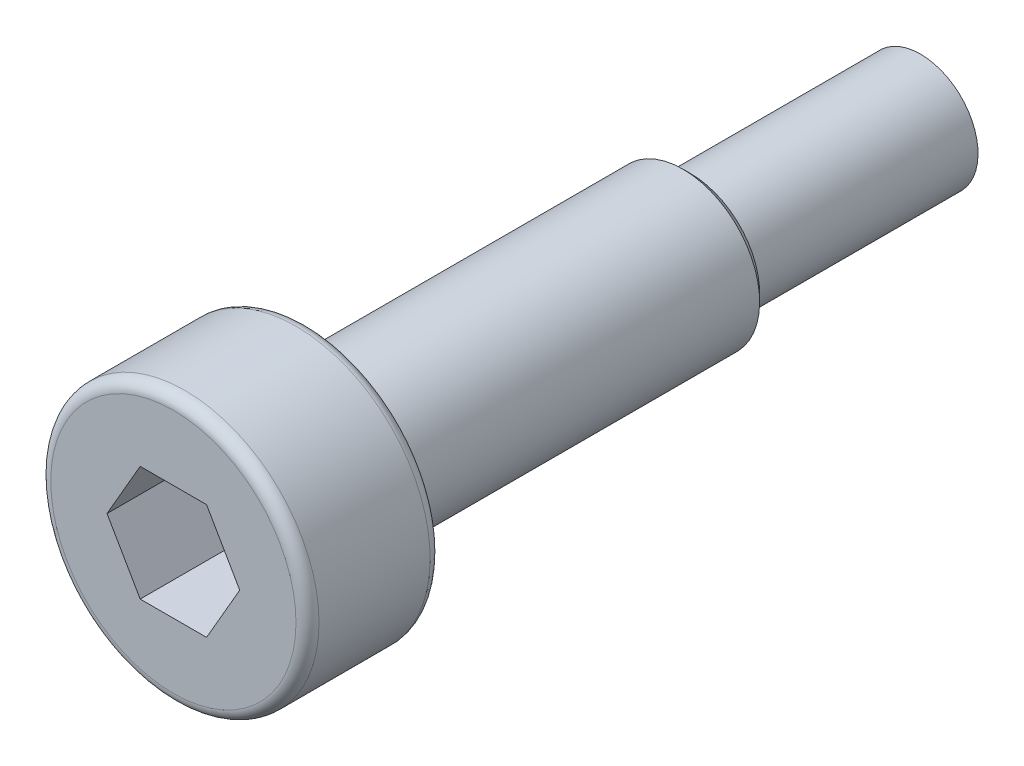
ISO-10303-21;
HEADER;
FILE_DESCRIPTION(('STEP AP214'),'2;1');
FILE_NAME('part.step','',(''),(''),'','','');
FILE_SCHEMA(('AUTOMOTIVE_DESIGN { 1 0 10303 214 1 1 1 1 }'));
ENDSEC;
DATA;
#1=APPLICATION_CONTEXT('core data for automotive mechanical design processes');
#2=APPLICATION_PROTOCOL_DEFINITION('international standard','automotive_design',2000,#1);
#3=PRODUCT_CONTEXT('',#1,'mechanical');
#4=PRODUCT('Part','Part','',(#3));
#5=PRODUCT_RELATED_PRODUCT_CATEGORY('part','',(#4));
#6=PRODUCT_DEFINITION_FORMATION('','',#4);
#7=PRODUCT_DEFINITION_CONTEXT('part definition',#1,'design');
#8=PRODUCT_DEFINITION('design','',#6,#7);
#9=PRODUCT_DEFINITION_SHAPE('','',#8);
#10=(LENGTH_UNIT() NAMED_UNIT(*) SI_UNIT(.MILLI.,.METRE.));
#11=(NAMED_UNIT(*) PLANE_ANGLE_UNIT() SI_UNIT($,.RADIAN.));
#12=(NAMED_UNIT(*) SI_UNIT($,.STERADIAN.) SOLID_ANGLE_UNIT());
#13=UNCERTAINTY_MEASURE_WITH_UNIT(LENGTH_MEASURE(1.E-05),#10,'distance_accuracy_value','');
#14=(GEOMETRIC_REPRESENTATION_CONTEXT(3) GLOBAL_UNCERTAINTY_ASSIGNED_CONTEXT((#13)) GLOBAL_UNIT_ASSIGNED_CONTEXT((#10,
#11,#12)) REPRESENTATION_CONTEXT('',''));
#15=CARTESIAN_POINT('',(0.,0.,0.));
#16=DIRECTION('',(0.,0.,1.));
#17=DIRECTION('',(1.,0.,0.));
#18=AXIS2_PLACEMENT_3D('',#15,#16,#17);
#19=CARTESIAN_POINT('',(0.,0.,0.));
#20=DIRECTION('',(0.,0.,-1.));
#21=DIRECTION('',(0.,1.,0.));
#22=AXIS2_PLACEMENT_3D('',#19,#20,#21);
#23=PLANE('',#22);
#24=CARTESIAN_POINT('',(0.,0.,0.));
#25=DIRECTION('',(0.,0.,-1.));
#26=DIRECTION('',(0.,1.,0.));
#27=AXIS2_PLACEMENT_3D('',#24,#25,#26);
#28=CIRCLE('',#27,1.5);
#29=CARTESIAN_POINT('',(0.,1.5,0.));
#30=VERTEX_POINT('',#29);
#31=EDGE_CURVE('E159',#30,#30,#28,.T.);
#32=ORIENTED_EDGE('',*,*,#31,.T.);
#33=EDGE_LOOP('',(#32));
#34=FACE_BOUND('',#33,.T.);
#35=ADVANCED_FACE('F45',(#34),#23,.T.);
#36=CARTESIAN_POINT('',(0.,0.,0.));
#37=DIRECTION('',(0.,0.,-1.));
#38=DIRECTION('',(0.,1.,0.));
#39=AXIS2_PLACEMENT_3D('',#36,#37,#38);
#40=CYLINDRICAL_SURFACE('',#39,1.5);
#41=CARTESIAN_POINT('',(0.,0.,6.));
#42=DIRECTION('',(0.,0.,-1.));
#43=DIRECTION('',(0.,1.,0.));
#44=AXIS2_PLACEMENT_3D('',#41,#42,#43);
#45=CIRCLE('',#44,1.5);
#46=CARTESIAN_POINT('',(0.,1.5,6.));
#47=VERTEX_POINT('',#46);
#48=EDGE_CURVE('E156',#47,#47,#45,.T.);
#49=ORIENTED_EDGE('',*,*,#48,.T.);
#50=EDGE_LOOP('',(#49));
#51=FACE_BOUND('',#50,.T.);
#52=ORIENTED_EDGE('',*,*,#31,.F.);
#53=EDGE_LOOP('',(#52));
#54=FACE_BOUND('',#53,.T.);
#55=ADVANCED_FACE('F188',(#51,#54),#40,.T.);
#56=CARTESIAN_POINT('',(0.,1.5,6.));
#57=DIRECTION('',(0.,0.,-1.));
#58=DIRECTION('',(0.,1.,0.));
#59=AXIS2_PLACEMENT_3D('',#56,#57,#58);
#60=PLANE('',#59);
#61=CARTESIAN_POINT('',(0.,0.,6.));
#62=DIRECTION('',(0.,0.,-1.));
#63=DIRECTION('',(0.,1.,0.));
#64=AXIS2_PLACEMENT_3D('',#61,#62,#63);
#65=CIRCLE('',#64,1.8);
#66=CARTESIAN_POINT('',(0.,1.8,6.));
#67=VERTEX_POINT('',#66);
#68=EDGE_CURVE('E54',#67,#67,#65,.T.);
#69=ORIENTED_EDGE('',*,*,#68,.T.);
#70=EDGE_LOOP('',(#69));
#71=FACE_BOUND('',#70,.T.);
#72=ORIENTED_EDGE('',*,*,#48,.F.);
#73=EDGE_LOOP('',(#72));
#74=FACE_BOUND('',#73,.T.);
#75=ADVANCED_FACE('F176',(#71,#74),#60,.T.);
#76=CARTESIAN_POINT('',(0.,0.,0.));
#77=DIRECTION('',(0.,0.,-1.));
#78=DIRECTION('',(0.,1.,0.));
#79=AXIS2_PLACEMENT_3D('',#76,#77,#78);
#80=CYLINDRICAL_SURFACE('',#79,2.);
#81=CARTESIAN_POINT('',(0.,0.,6.2));
#82=DIRECTION('',(0.,0.,-1.));
#83=DIRECTION('',(0.,1.,0.));
#84=AXIS2_PLACEMENT_3D('',#81,#82,#83);
#85=CIRCLE('',#84,2.);
#86=CARTESIAN_POINT('',(0.,2.,6.2));
#87=VERTEX_POINT('',#86);
#88=EDGE_CURVE('E11',#87,#87,#85,.F.);
#89=ORIENTED_EDGE('',*,*,#88,.T.);
#90=EDGE_LOOP('',(#89));
#91=FACE_BOUND('',#90,.T.);
#92=CARTESIAN_POINT('',(0.,0.,16.));
#93=DIRECTION('',(0.,0.,-1.));
#94=DIRECTION('',(0.,1.,0.));
#95=AXIS2_PLACEMENT_3D('',#92,#93,#94);
#96=CIRCLE('',#95,2.);
#97=CARTESIAN_POINT('',(0.,2.,16.));
#98=VERTEX_POINT('',#97);
#99=EDGE_CURVE('E148',#98,#98,#96,.T.);
#100=ORIENTED_EDGE('',*,*,#99,.T.);
#101=EDGE_LOOP('',(#100));
#102=FACE_BOUND('',#101,.T.);
#103=ADVANCED_FACE('F226',(#91,#102),#80,.T.);
#104=CARTESIAN_POINT('',(0.,2.,16.));
#105=DIRECTION('',(0.,0.,-1.));
#106=DIRECTION('',(0.,1.,0.));
#107=AXIS2_PLACEMENT_3D('',#104,#105,#106);
#108=PLANE('',#107);
#109=CARTESIAN_POINT('',(0.,0.,16.));
#110=DIRECTION('',(0.,0.,-1.));
#111=DIRECTION('',(0.,1.,0.));
#112=AXIS2_PLACEMENT_3D('',#109,#110,#111);
#113=CIRCLE('',#112,3.2);
#114=CARTESIAN_POINT('',(0.,3.2,16.));
#115=VERTEX_POINT('',#114);
#116=EDGE_CURVE('E162',#115,#115,#113,.T.);
#117=ORIENTED_EDGE('',*,*,#116,.T.);
#118=EDGE_LOOP('',(#117));
#119=FACE_BOUND('',#118,.T.);
#120=ORIENTED_EDGE('',*,*,#99,.F.);
#121=EDGE_LOOP('',(#120));
#122=FACE_BOUND('',#121,.T.);
#123=ADVANCED_FACE('F217',(#119,#122),#108,.T.);
#124=CARTESIAN_POINT('',(0.,0.,0.));
#125=DIRECTION('',(0.,0.,-1.));
#126=DIRECTION('',(0.,1.,0.));
#127=AXIS2_PLACEMENT_3D('',#124,#125,#126);
#128=CYLINDRICAL_SURFACE('',#127,3.5);
#129=CARTESIAN_POINT('',(0.,0.,16.3));
#130=DIRECTION('',(0.,0.,-1.));
#131=DIRECTION('',(0.,1.,0.));
#132=AXIS2_PLACEMENT_3D('',#129,#130,#131);
#133=CIRCLE('',#132,3.5);
#134=CARTESIAN_POINT('',(0.,3.5,16.3));
#135=VERTEX_POINT('',#134);
#136=EDGE_CURVE('E168',#135,#135,#133,.F.);
#137=ORIENTED_EDGE('',*,*,#136,.T.);
#138=EDGE_LOOP('',(#137));
#139=FACE_BOUND('',#138,.T.);
#140=CARTESIAN_POINT('',(0.,0.,19.2));
#141=DIRECTION('',(0.,0.,1.));
#142=DIRECTION('',(0.,-1.,0.));
#143=AXIS2_PLACEMENT_3D('',#140,#141,#142);
#144=CIRCLE('',#143,3.5);
#145=CARTESIAN_POINT('',(0.,-3.5,19.2));
#146=VERTEX_POINT('',#145);
#147=EDGE_CURVE('E165',#146,#146,#144,.F.);
#148=ORIENTED_EDGE('',*,*,#147,.T.);
#149=EDGE_LOOP('',(#148));
#150=FACE_BOUND('',#149,.T.);
#151=ADVANCED_FACE('F215',(#139,#150),#128,.T.);
#152=CARTESIAN_POINT('',(0.,3.5,19.5));
#153=DIRECTION('',(0.,0.,1.));
#154=DIRECTION('',(0.,-1.,0.));
#155=AXIS2_PLACEMENT_3D('',#152,#153,#154);
#156=PLANE('',#155);
#157=DIRECTION('',(0.5,0.866025403784439,0.));
#158=VECTOR('',#157,1.);
#159=CARTESIAN_POINT('',(0.866025403784438,-1.5,19.5));
#160=LINE('',#159,#158);
#161=CARTESIAN_POINT('',(0.866025403784438,-1.5,19.5));
#162=VERTEX_POINT('',#161);
#163=CARTESIAN_POINT('',(1.73205080756888,0.,19.5));
#164=VERTEX_POINT('',#163);
#165=EDGE_CURVE('E61',#162,#164,#160,.T.);
#166=ORIENTED_EDGE('',*,*,#165,.F.);
#167=DIRECTION('',(1.,0.,0.));
#168=VECTOR('',#167,1.);
#169=CARTESIAN_POINT('',(-0.866025403784439,-1.5,19.5));
#170=LINE('',#169,#168);
#171=CARTESIAN_POINT('',(-0.866025403784439,-1.5,19.5));
#172=VERTEX_POINT('',#171);
#173=EDGE_CURVE('E144',#172,#162,#170,.T.);
#174=ORIENTED_EDGE('',*,*,#173,.F.);
#175=DIRECTION('',(0.5,-0.866025403784439,0.));
#176=VECTOR('',#175,1.);
#177=CARTESIAN_POINT('',(-1.73205080756888,0.,19.5));
#178=LINE('',#177,#176);
#179=CARTESIAN_POINT('',(-1.73205080756888,0.,19.5));
#180=VERTEX_POINT('',#179);
#181=EDGE_CURVE('E142',#180,#172,#178,.T.);
#182=ORIENTED_EDGE('',*,*,#181,.F.);
#183=DIRECTION('',(-0.5,-0.866025403784439,0.));
#184=VECTOR('',#183,1.);
#185=CARTESIAN_POINT('',(-0.866025403784439,1.5,19.5));
#186=LINE('',#185,#184);
#187=CARTESIAN_POINT('',(-0.866025403784439,1.5,19.5));
#188=VERTEX_POINT('',#187);
#189=EDGE_CURVE('E109',#188,#180,#186,.T.);
#190=ORIENTED_EDGE('',*,*,#189,.F.);
#191=DIRECTION('',(-1.,0.,0.));
#192=VECTOR('',#191,1.);
#193=CARTESIAN_POINT('',(0.866025403784437,1.5,19.5));
#194=LINE('',#193,#192);
#195=CARTESIAN_POINT('',(0.866025403784437,1.5,19.5));
#196=VERTEX_POINT('',#195);
#197=EDGE_CURVE('E138',#196,#188,#194,.T.);
#198=ORIENTED_EDGE('',*,*,#197,.F.);
#199=DIRECTION('',(-0.5,0.866025403784439,0.));
#200=VECTOR('',#199,1.);
#201=CARTESIAN_POINT('',(1.73205080756888,0.,19.5));
#202=LINE('',#201,#200);
#203=EDGE_CURVE('E135',#164,#196,#202,.T.);
#204=ORIENTED_EDGE('',*,*,#203,.F.);
#205=EDGE_LOOP('',(#166,#174,#182,#190,#198,#204));
#206=FACE_BOUND('',#205,.T.);
#207=CARTESIAN_POINT('',(0.,0.,19.5));
#208=DIRECTION('',(0.,0.,1.));
#209=DIRECTION('',(0.,-1.,0.));
#210=AXIS2_PLACEMENT_3D('',#207,#208,#209);
#211=CIRCLE('',#210,3.2);
#212=CARTESIAN_POINT('',(0.,-3.2,19.5));
#213=VERTEX_POINT('',#212);
#214=EDGE_CURVE('E171',#213,#213,#211,.T.);
#215=ORIENTED_EDGE('',*,*,#214,.T.);
#216=EDGE_LOOP('',(#215));
#217=FACE_BOUND('',#216,.T.);
#218=ADVANCED_FACE('F201',(#206,#217),#156,.T.);
#219=CARTESIAN_POINT('',(0.,0.,16.3));
#220=DIRECTION('',(0.,0.,-1.));
#221=DIRECTION('',(0.,1.,0.));
#222=AXIS2_PLACEMENT_3D('',#219,#220,#221);
#223=TOROIDAL_SURFACE('',#222,3.2,0.3);
#224=ORIENTED_EDGE('',*,*,#136,.F.);
#225=EDGE_LOOP('',(#224));
#226=FACE_BOUND('',#225,.T.);
#227=ORIENTED_EDGE('',*,*,#116,.F.);
#228=EDGE_LOOP('',(#227));
#229=FACE_BOUND('',#228,.T.);
#230=ADVANCED_FACE('F198',(#226,#229),#223,.T.);
#231=CARTESIAN_POINT('',(0.,0.,19.2));
#232=DIRECTION('',(0.,0.,1.));
#233=DIRECTION('',(0.,-1.,0.));
#234=AXIS2_PLACEMENT_3D('',#231,#232,#233);
#235=TOROIDAL_SURFACE('',#234,3.2,0.3);
#236=ORIENTED_EDGE('',*,*,#214,.F.);
#237=EDGE_LOOP('',(#236));
#238=FACE_BOUND('',#237,.T.);
#239=ORIENTED_EDGE('',*,*,#147,.F.);
#240=EDGE_LOOP('',(#239));
#241=FACE_BOUND('',#240,.T.);
#242=ADVANCED_FACE('F200',(#238,#241),#235,.T.);
#243=CARTESIAN_POINT('',(0.866025403784438,-1.5,17.1));
#244=DIRECTION('',(0.866025403784439,-0.5,0.));
#245=DIRECTION('',(0.5,0.866025403784439,0.));
#246=AXIS2_PLACEMENT_3D('',#243,#244,#245);
#247=PLANE('',#246);
#248=ORIENTED_EDGE('',*,*,#165,.T.);
#249=DIRECTION('',(0.,0.,1.));
#250=VECTOR('',#249,1.);
#251=CARTESIAN_POINT('',(1.73205080756888,0.,17.1));
#252=LINE('',#251,#250);
#253=CARTESIAN_POINT('',(1.73205080756888,0.,17.1));
#254=VERTEX_POINT('',#253);
#255=EDGE_CURVE('E91',#254,#164,#252,.T.);
#256=ORIENTED_EDGE('',*,*,#255,.F.);
#257=DIRECTION('',(0.5,0.866025403784439,0.));
#258=VECTOR('',#257,1.);
#259=CARTESIAN_POINT('',(0.866025403784438,-1.5,17.1));
#260=LINE('',#259,#258);
#261=CARTESIAN_POINT('',(0.866025403784438,-1.5,17.1));
#262=VERTEX_POINT('',#261);
#263=EDGE_CURVE('E146',#262,#254,#260,.T.);
#264=ORIENTED_EDGE('',*,*,#263,.F.);
#265=DIRECTION('',(0.,0.,1.));
#266=VECTOR('',#265,1.);
#267=CARTESIAN_POINT('',(0.866025403784438,-1.5,17.1));
#268=LINE('',#267,#266);
#269=EDGE_CURVE('E69',#262,#162,#268,.T.);
#270=ORIENTED_EDGE('',*,*,#269,.T.);
#271=EDGE_LOOP('',(#248,#256,#264,#270));
#272=FACE_BOUND('',#271,.T.);
#273=ADVANCED_FACE('F204',(#272),#247,.F.);
#274=CARTESIAN_POINT('',(-0.866025403784439,-1.5,17.1));
#275=DIRECTION('',(0.,-1.,0.));
#276=DIRECTION('',(1.,0.,0.));
#277=AXIS2_PLACEMENT_3D('',#274,#275,#276);
#278=PLANE('',#277);
#279=ORIENTED_EDGE('',*,*,#173,.T.);
#280=ORIENTED_EDGE('',*,*,#269,.F.);
#281=DIRECTION('',(1.,0.,0.));
#282=VECTOR('',#281,1.);
#283=CARTESIAN_POINT('',(-0.866025403784439,-1.5,17.1));
#284=LINE('',#283,#282);
#285=CARTESIAN_POINT('',(-0.866025403784439,-1.5,17.1));
#286=VERTEX_POINT('',#285);
#287=EDGE_CURVE('E121',#286,#262,#284,.T.);
#288=ORIENTED_EDGE('',*,*,#287,.F.);
#289=DIRECTION('',(0.,0.,1.));
#290=VECTOR('',#289,1.);
#291=CARTESIAN_POINT('',(-0.866025403784439,-1.5,17.1));
#292=LINE('',#291,#290);
#293=EDGE_CURVE('E113',#286,#172,#292,.T.);
#294=ORIENTED_EDGE('',*,*,#293,.T.);
#295=EDGE_LOOP('',(#279,#280,#288,#294));
#296=FACE_BOUND('',#295,.T.);
#297=ADVANCED_FACE('F209',(#296),#278,.F.);
#298=CARTESIAN_POINT('',(-1.73205080756888,0.,17.1));
#299=DIRECTION('',(-0.866025403784439,-0.5,0.));
#300=DIRECTION('',(0.5,-0.866025403784439,0.));
#301=AXIS2_PLACEMENT_3D('',#298,#299,#300);
#302=PLANE('',#301);
#303=ORIENTED_EDGE('',*,*,#181,.T.);
#304=ORIENTED_EDGE('',*,*,#293,.F.);
#305=DIRECTION('',(0.5,-0.866025403784439,0.));
#306=VECTOR('',#305,1.);
#307=CARTESIAN_POINT('',(-1.73205080756888,0.,17.1));
#308=LINE('',#307,#306);
#309=CARTESIAN_POINT('',(-1.73205080756888,0.,17.1));
#310=VERTEX_POINT('',#309);
#311=EDGE_CURVE('E117',#310,#286,#308,.T.);
#312=ORIENTED_EDGE('',*,*,#311,.F.);
#313=DIRECTION('',(0.,0.,1.));
#314=VECTOR('',#313,1.);
#315=CARTESIAN_POINT('',(-1.73205080756888,0.,17.1));
#316=LINE('',#315,#314);
#317=EDGE_CURVE('E102',#310,#180,#316,.T.);
#318=ORIENTED_EDGE('',*,*,#317,.T.);
#319=EDGE_LOOP('',(#303,#304,#312,#318));
#320=FACE_BOUND('',#319,.T.);
#321=ADVANCED_FACE('F118',(#320),#302,.F.);
#322=CARTESIAN_POINT('',(-0.866025403784439,1.5,17.1));
#323=DIRECTION('',(-0.866025403784439,0.5,0.));
#324=DIRECTION('',(-0.5,-0.866025403784439,0.));
#325=AXIS2_PLACEMENT_3D('',#322,#323,#324);
#326=PLANE('',#325);
#327=ORIENTED_EDGE('',*,*,#189,.T.);
#328=ORIENTED_EDGE('',*,*,#317,.F.);
#329=DIRECTION('',(-0.5,-0.866025403784439,0.));
#330=VECTOR('',#329,1.);
#331=CARTESIAN_POINT('',(-0.866025403784439,1.5,17.1));
#332=LINE('',#331,#330);
#333=CARTESIAN_POINT('',(-0.866025403784439,1.5,17.1));
#334=VERTEX_POINT('',#333);
#335=EDGE_CURVE('E106',#334,#310,#332,.T.);
#336=ORIENTED_EDGE('',*,*,#335,.F.);
#337=DIRECTION('',(0.,0.,1.));
#338=VECTOR('',#337,1.);
#339=CARTESIAN_POINT('',(-0.866025403784439,1.5,17.1));
#340=LINE('',#339,#338);
#341=EDGE_CURVE('E114',#334,#188,#340,.T.);
#342=ORIENTED_EDGE('',*,*,#341,.T.);
#343=EDGE_LOOP('',(#327,#328,#336,#342));
#344=FACE_BOUND('',#343,.T.);
#345=ADVANCED_FACE('F104',(#344),#326,.F.);
#346=CARTESIAN_POINT('',(0.866025403784437,1.5,17.1));
#347=DIRECTION('',(0.,1.,0.));
#348=DIRECTION('',(-1.,0.,0.));
#349=AXIS2_PLACEMENT_3D('',#346,#347,#348);
#350=PLANE('',#349);
#351=ORIENTED_EDGE('',*,*,#197,.T.);
#352=ORIENTED_EDGE('',*,*,#341,.F.);
#353=DIRECTION('',(-1.,0.,0.));
#354=VECTOR('',#353,1.);
#355=CARTESIAN_POINT('',(0.866025403784437,1.5,17.1));
#356=LINE('',#355,#354);
#357=CARTESIAN_POINT('',(0.866025403784437,1.5,17.1));
#358=VERTEX_POINT('',#357);
#359=EDGE_CURVE('E127',#358,#334,#356,.T.);
#360=ORIENTED_EDGE('',*,*,#359,.F.);
#361=DIRECTION('',(0.,0.,1.));
#362=VECTOR('',#361,1.);
#363=CARTESIAN_POINT('',(0.866025403784437,1.5,17.1));
#364=LINE('',#363,#362);
#365=EDGE_CURVE('E151',#358,#196,#364,.T.);
#366=ORIENTED_EDGE('',*,*,#365,.T.);
#367=EDGE_LOOP('',(#351,#352,#360,#366));
#368=FACE_BOUND('',#367,.T.);
#369=ADVANCED_FACE('F300',(#368),#350,.F.);
#370=CARTESIAN_POINT('',(1.73205080756888,0.,17.1));
#371=DIRECTION('',(0.866025403784439,0.5,0.));
#372=DIRECTION('',(-0.5,0.866025403784439,0.));
#373=AXIS2_PLACEMENT_3D('',#370,#371,#372);
#374=PLANE('',#373);
#375=ORIENTED_EDGE('',*,*,#203,.T.);
#376=ORIENTED_EDGE('',*,*,#365,.F.);
#377=DIRECTION('',(-0.5,0.866025403784439,0.));
#378=VECTOR('',#377,1.);
#379=CARTESIAN_POINT('',(1.73205080756888,0.,17.1));
#380=LINE('',#379,#378);
#381=EDGE_CURVE('E129',#254,#358,#380,.T.);
#382=ORIENTED_EDGE('',*,*,#381,.F.);
#383=ORIENTED_EDGE('',*,*,#255,.T.);
#384=EDGE_LOOP('',(#375,#376,#382,#383));
#385=FACE_BOUND('',#384,.T.);
#386=ADVANCED_FACE('F184',(#385),#374,.F.);
#387=CARTESIAN_POINT('',(0.,0.,17.1));
#388=DIRECTION('',(0.,0.,1.));
#389=DIRECTION('',(1.,0.,0.));
#390=AXIS2_PLACEMENT_3D('',#387,#388,#389);
#391=PLANE('',#390);
#392=ORIENTED_EDGE('',*,*,#263,.T.);
#393=ORIENTED_EDGE('',*,*,#381,.T.);
#394=ORIENTED_EDGE('',*,*,#359,.T.);
#395=ORIENTED_EDGE('',*,*,#335,.T.);
#396=ORIENTED_EDGE('',*,*,#311,.T.);
#397=ORIENTED_EDGE('',*,*,#287,.T.);
#398=EDGE_LOOP('',(#392,#393,#394,#395,#396,#397));
#399=FACE_BOUND('',#398,.T.);
#400=ADVANCED_FACE('F124',(#399),#391,.T.);
#401=CARTESIAN_POINT('',(0.,0.,6.));
#402=DIRECTION('',(0.,0.,1.));
#403=DIRECTION('',(0.,-1.,0.));
#404=AXIS2_PLACEMENT_3D('',#401,#402,#403);
#405=CONICAL_SURFACE('',#404,1.8,0.785398163397449);
#406=ORIENTED_EDGE('',*,*,#88,.F.);
#407=EDGE_LOOP('',(#406));
#408=FACE_BOUND('',#407,.T.);
#409=ORIENTED_EDGE('',*,*,#68,.F.);
#410=EDGE_LOOP('',(#409));
#411=FACE_BOUND('',#410,.T.);
#412=ADVANCED_FACE('F48',(#408,#411),#405,.T.);
#413=CLOSED_SHELL('',(#35,#55,#75,#103,#123,#151,#218,#230,#242,#273,#297,#321,#345,#369,#386,
#400,#412));
#414=MANIFOLD_SOLID_BREP('B2',#413);
#415=ADVANCED_BREP_SHAPE_REPRESENTATION('',(#18,#414),#14);
#416=SHAPE_DEFINITION_REPRESENTATION(#9,#415);
ENDSEC;
END-ISO-10303-21;
